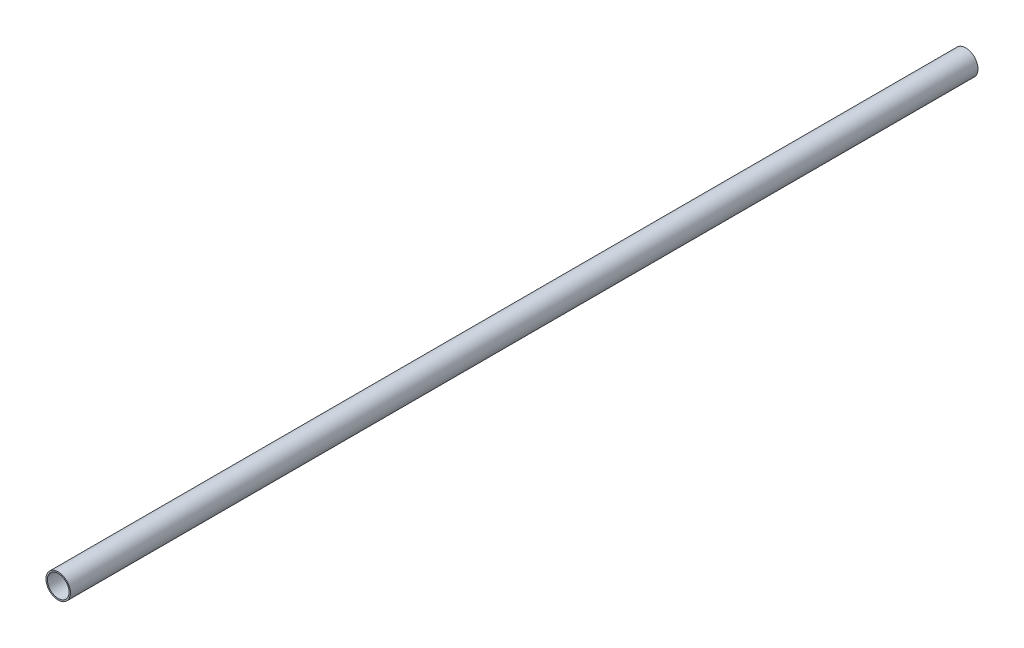
ISO-10303-21;
HEADER;
FILE_DESCRIPTION(('STEP AP214'),'2;1');
FILE_NAME('part.step','',(''),(''),'','','');
FILE_SCHEMA(('AUTOMOTIVE_DESIGN { 1 0 10303 214 1 1 1 1 }'));
ENDSEC;
DATA;
#1=APPLICATION_CONTEXT('core data for automotive mechanical design processes');
#2=APPLICATION_PROTOCOL_DEFINITION('international standard','automotive_design',2000,#1);
#3=PRODUCT_CONTEXT('',#1,'mechanical');
#4=PRODUCT('Part','Part','',(#3));
#5=PRODUCT_RELATED_PRODUCT_CATEGORY('part','',(#4));
#6=PRODUCT_DEFINITION_FORMATION('','',#4);
#7=PRODUCT_DEFINITION_CONTEXT('part definition',#1,'design');
#8=PRODUCT_DEFINITION('design','',#6,#7);
#9=PRODUCT_DEFINITION_SHAPE('','',#8);
#10=(LENGTH_UNIT() NAMED_UNIT(*) SI_UNIT(.MILLI.,.METRE.));
#11=(NAMED_UNIT(*) PLANE_ANGLE_UNIT() SI_UNIT($,.RADIAN.));
#12=(NAMED_UNIT(*) SI_UNIT($,.STERADIAN.) SOLID_ANGLE_UNIT());
#13=UNCERTAINTY_MEASURE_WITH_UNIT(LENGTH_MEASURE(1.E-05),#10,'distance_accuracy_value','');
#14=(GEOMETRIC_REPRESENTATION_CONTEXT(3) GLOBAL_UNCERTAINTY_ASSIGNED_CONTEXT((#13)) GLOBAL_UNIT_ASSIGNED_CONTEXT((#10,
#11,#12)) REPRESENTATION_CONTEXT('',''));
#15=CARTESIAN_POINT('',(0.,0.,0.));
#16=DIRECTION('',(0.,0.,1.));
#17=DIRECTION('',(1.,0.,0.));
#18=AXIS2_PLACEMENT_3D('',#15,#16,#17);
#19=CARTESIAN_POINT('',(0.,0.,1231.9));
#20=DIRECTION('',(0.,0.,1.));
#21=DIRECTION('',(1.,0.,0.));
#22=AXIS2_PLACEMENT_3D('',#19,#20,#21);
#23=PLANE('',#22);
#24=CARTESIAN_POINT('',(0.,0.,1231.9));
#25=DIRECTION('',(0.,0.,1.));
#26=DIRECTION('',(1.,0.,0.));
#27=AXIS2_PLACEMENT_3D('',#24,#25,#26);
#28=CIRCLE('',#27,16.59255);
#29=CARTESIAN_POINT('',(16.59255,0.,1231.9));
#30=VERTEX_POINT('',#29);
#31=EDGE_CURVE('E10',#30,#30,#28,.T.);
#32=ORIENTED_EDGE('',*,*,#31,.T.);
#33=EDGE_LOOP('',(#32));
#34=FACE_BOUND('',#33,.T.);
#35=CARTESIAN_POINT('',(0.,0.,1231.9));
#36=DIRECTION('',(0.,0.,1.));
#37=DIRECTION('',(1.,0.,0.));
#38=AXIS2_PLACEMENT_3D('',#35,#36,#37);
#39=CIRCLE('',#38,14.72565);
#40=CARTESIAN_POINT('',(14.72565,0.,1231.9));
#41=VERTEX_POINT('',#40);
#42=EDGE_CURVE('E41',#41,#41,#39,.T.);
#43=ORIENTED_EDGE('',*,*,#42,.F.);
#44=EDGE_LOOP('',(#43));
#45=FACE_BOUND('',#44,.T.);
#46=ADVANCED_FACE('F30',(#34,#45),#23,.T.);
#47=CARTESIAN_POINT('',(0.,0.,0.));
#48=DIRECTION('',(0.,0.,1.));
#49=DIRECTION('',(1.,0.,0.));
#50=AXIS2_PLACEMENT_3D('',#47,#48,#49);
#51=PLANE('',#50);
#52=CARTESIAN_POINT('',(0.,0.,0.));
#53=DIRECTION('',(0.,0.,1.));
#54=DIRECTION('',(1.,0.,0.));
#55=AXIS2_PLACEMENT_3D('',#52,#53,#54);
#56=CIRCLE('',#55,16.59255);
#57=CARTESIAN_POINT('',(16.59255,0.,0.));
#58=VERTEX_POINT('',#57);
#59=EDGE_CURVE('E34',#58,#58,#56,.T.);
#60=ORIENTED_EDGE('',*,*,#59,.F.);
#61=EDGE_LOOP('',(#60));
#62=FACE_BOUND('',#61,.T.);
#63=CARTESIAN_POINT('',(0.,0.,0.));
#64=DIRECTION('',(0.,0.,1.));
#65=DIRECTION('',(1.,0.,0.));
#66=AXIS2_PLACEMENT_3D('',#63,#64,#65);
#67=CIRCLE('',#66,14.72565);
#68=CARTESIAN_POINT('',(14.72565,0.,0.));
#69=VERTEX_POINT('',#68);
#70=EDGE_CURVE('E43',#69,#69,#67,.T.);
#71=ORIENTED_EDGE('',*,*,#70,.T.);
#72=EDGE_LOOP('',(#71));
#73=FACE_BOUND('',#72,.T.);
#74=ADVANCED_FACE('F53',(#62,#73),#51,.F.);
#75=CARTESIAN_POINT('',(0.,0.,1231.9));
#76=DIRECTION('',(0.,0.,-1.));
#77=DIRECTION('',(-1.,0.,0.));
#78=AXIS2_PLACEMENT_3D('',#75,#76,#77);
#79=CYLINDRICAL_SURFACE('',#78,16.59255);
#80=ORIENTED_EDGE('',*,*,#31,.F.);
#81=EDGE_LOOP('',(#80));
#82=FACE_BOUND('',#81,.T.);
#83=ORIENTED_EDGE('',*,*,#59,.T.);
#84=EDGE_LOOP('',(#83));
#85=FACE_BOUND('',#84,.T.);
#86=ADVANCED_FACE('F32',(#82,#85),#79,.T.);
#87=CARTESIAN_POINT('',(0.,0.,1231.9));
#88=DIRECTION('',(0.,0.,-1.));
#89=DIRECTION('',(-1.,0.,0.));
#90=AXIS2_PLACEMENT_3D('',#87,#88,#89);
#91=CYLINDRICAL_SURFACE('',#90,14.72565);
#92=ORIENTED_EDGE('',*,*,#42,.T.);
#93=EDGE_LOOP('',(#92));
#94=FACE_BOUND('',#93,.T.);
#95=ORIENTED_EDGE('',*,*,#70,.F.);
#96=EDGE_LOOP('',(#95));
#97=FACE_BOUND('',#96,.T.);
#98=ADVANCED_FACE('F49',(#94,#97),#91,.F.);
#99=CLOSED_SHELL('',(#46,#74,#86,#98));
#100=MANIFOLD_SOLID_BREP('B2',#99);
#101=ADVANCED_BREP_SHAPE_REPRESENTATION('',(#18,#100),#14);
#102=SHAPE_DEFINITION_REPRESENTATION(#9,#101);
ENDSEC;
END-ISO-10303-21;
